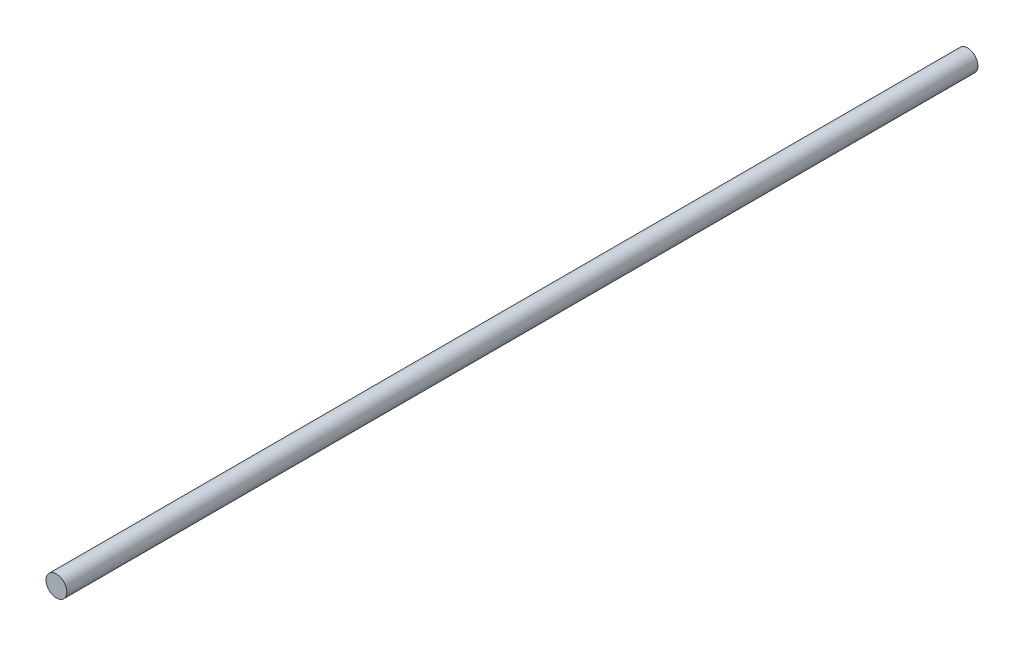
ISO-10303-21;
HEADER;
FILE_DESCRIPTION(('STEP AP214'),'2;1');
FILE_NAME('part.step','',(''),(''),'','','');
FILE_SCHEMA(('AUTOMOTIVE_DESIGN { 1 0 10303 214 1 1 1 1 }'));
ENDSEC;
DATA;
#1=APPLICATION_CONTEXT('core data for automotive mechanical design processes');
#2=APPLICATION_PROTOCOL_DEFINITION('international standard','automotive_design',2000,#1);
#3=PRODUCT_CONTEXT('',#1,'mechanical');
#4=PRODUCT('Part','Part','',(#3));
#5=PRODUCT_RELATED_PRODUCT_CATEGORY('part','',(#4));
#6=PRODUCT_DEFINITION_FORMATION('','',#4);
#7=PRODUCT_DEFINITION_CONTEXT('part definition',#1,'design');
#8=PRODUCT_DEFINITION('design','',#6,#7);
#9=PRODUCT_DEFINITION_SHAPE('','',#8);
#10=(LENGTH_UNIT() NAMED_UNIT(*) SI_UNIT(.MILLI.,.METRE.));
#11=(NAMED_UNIT(*) PLANE_ANGLE_UNIT() SI_UNIT($,.RADIAN.));
#12=(NAMED_UNIT(*) SI_UNIT($,.STERADIAN.) SOLID_ANGLE_UNIT());
#13=UNCERTAINTY_MEASURE_WITH_UNIT(LENGTH_MEASURE(1.E-05),#10,'distance_accuracy_value','');
#14=(GEOMETRIC_REPRESENTATION_CONTEXT(3) GLOBAL_UNCERTAINTY_ASSIGNED_CONTEXT((#13)) GLOBAL_UNIT_ASSIGNED_CONTEXT((#10,
#11,#12)) REPRESENTATION_CONTEXT('',''));
#15=CARTESIAN_POINT('',(0.,0.,0.));
#16=DIRECTION('',(0.,0.,1.));
#17=DIRECTION('',(1.,0.,0.));
#18=AXIS2_PLACEMENT_3D('',#15,#16,#17);
#19=CARTESIAN_POINT('',(0.,0.,350.));
#20=DIRECTION('',(0.,0.,-1.));
#21=DIRECTION('',(-1.,0.,0.));
#22=AXIS2_PLACEMENT_3D('',#19,#20,#21);
#23=CYLINDRICAL_SURFACE('',#22,4.);
#24=CARTESIAN_POINT('',(0.,0.,350.));
#25=DIRECTION('',(0.,0.,1.));
#26=DIRECTION('',(1.,0.,0.));
#27=AXIS2_PLACEMENT_3D('',#24,#25,#26);
#28=CIRCLE('',#27,4.);
#29=CARTESIAN_POINT('',(4.,0.,350.));
#30=VERTEX_POINT('',#29);
#31=EDGE_CURVE('E10',#30,#30,#28,.T.);
#32=ORIENTED_EDGE('',*,*,#31,.F.);
#33=EDGE_LOOP('',(#32));
#34=FACE_BOUND('',#33,.T.);
#35=CARTESIAN_POINT('',(0.,0.,0.));
#36=DIRECTION('',(0.,0.,1.));
#37=DIRECTION('',(1.,0.,0.));
#38=AXIS2_PLACEMENT_3D('',#35,#36,#37);
#39=CIRCLE('',#38,4.);
#40=CARTESIAN_POINT('',(4.,0.,0.));
#41=VERTEX_POINT('',#40);
#42=EDGE_CURVE('E33',#41,#41,#39,.T.);
#43=ORIENTED_EDGE('',*,*,#42,.T.);
#44=EDGE_LOOP('',(#43));
#45=FACE_BOUND('',#44,.T.);
#46=ADVANCED_FACE('F30',(#34,#45),#23,.T.);
#47=CARTESIAN_POINT('',(0.,0.,350.));
#48=DIRECTION('',(0.,0.,1.));
#49=DIRECTION('',(1.,0.,0.));
#50=AXIS2_PLACEMENT_3D('',#47,#48,#49);
#51=PLANE('',#50);
#52=ORIENTED_EDGE('',*,*,#31,.T.);
#53=EDGE_LOOP('',(#52));
#54=FACE_BOUND('',#53,.T.);
#55=ADVANCED_FACE('F45',(#54),#51,.T.);
#56=CARTESIAN_POINT('',(0.,0.,0.));
#57=DIRECTION('',(0.,0.,1.));
#58=DIRECTION('',(1.,0.,0.));
#59=AXIS2_PLACEMENT_3D('',#56,#57,#58);
#60=PLANE('',#59);
#61=ORIENTED_EDGE('',*,*,#42,.F.);
#62=EDGE_LOOP('',(#61));
#63=FACE_BOUND('',#62,.T.);
#64=ADVANCED_FACE('F43',(#63),#60,.F.);
#65=CLOSED_SHELL('',(#46,#55,#64));
#66=MANIFOLD_SOLID_BREP('B2',#65);
#67=ADVANCED_BREP_SHAPE_REPRESENTATION('',(#18,#66),#14);
#68=SHAPE_DEFINITION_REPRESENTATION(#9,#67);
ENDSEC;
END-ISO-10303-21;
